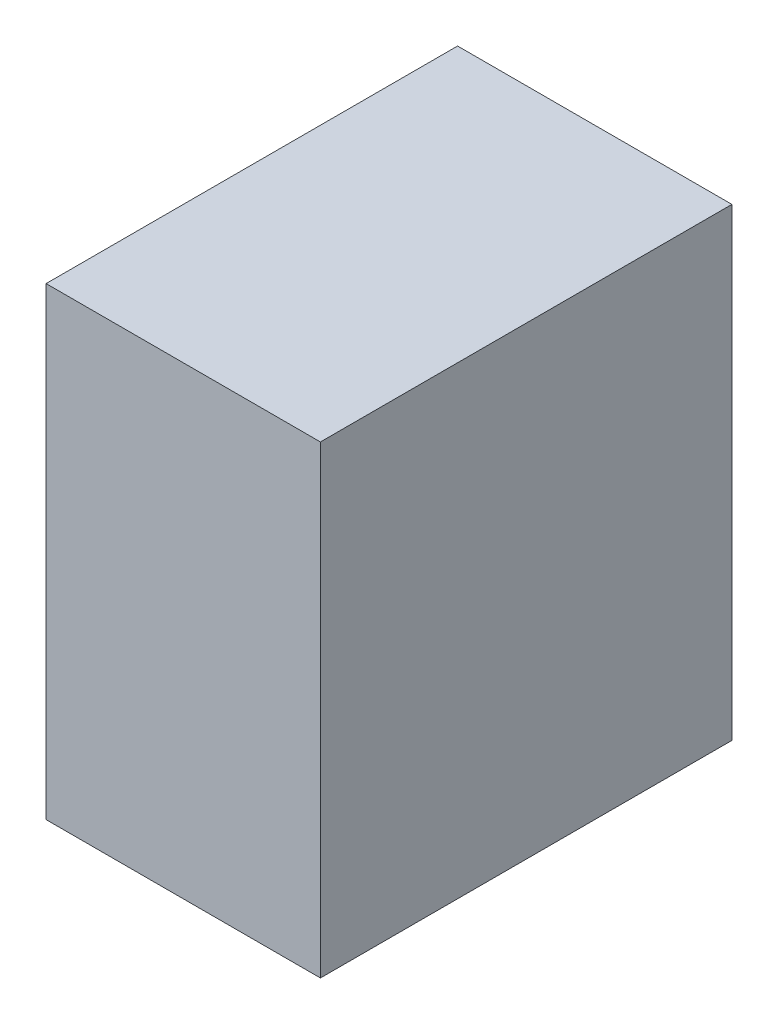
ISO-10303-21;
HEADER;
FILE_DESCRIPTION(('STEP AP214'),'2;1');
FILE_NAME('part.step','',(''),(''),'','','');
FILE_SCHEMA(('AUTOMOTIVE_DESIGN { 1 0 10303 214 1 1 1 1 }'));
ENDSEC;
DATA;
#1=APPLICATION_CONTEXT('core data for automotive mechanical design processes');
#2=APPLICATION_PROTOCOL_DEFINITION('international standard','automotive_design',2000,#1);
#3=PRODUCT_CONTEXT('',#1,'mechanical');
#4=PRODUCT('Part','Part','',(#3));
#5=PRODUCT_RELATED_PRODUCT_CATEGORY('part','',(#4));
#6=PRODUCT_DEFINITION_FORMATION('','',#4);
#7=PRODUCT_DEFINITION_CONTEXT('part definition',#1,'design');
#8=PRODUCT_DEFINITION('design','',#6,#7);
#9=PRODUCT_DEFINITION_SHAPE('','',#8);
#10=(LENGTH_UNIT() NAMED_UNIT(*) SI_UNIT(.MILLI.,.METRE.));
#11=(NAMED_UNIT(*) PLANE_ANGLE_UNIT() SI_UNIT($,.RADIAN.));
#12=(NAMED_UNIT(*) SI_UNIT($,.STERADIAN.) SOLID_ANGLE_UNIT());
#13=UNCERTAINTY_MEASURE_WITH_UNIT(LENGTH_MEASURE(1.E-05),#10,'distance_accuracy_value','');
#14=(GEOMETRIC_REPRESENTATION_CONTEXT(3) GLOBAL_UNCERTAINTY_ASSIGNED_CONTEXT((#13)) GLOBAL_UNIT_ASSIGNED_CONTEXT((#10,
#11,#12)) REPRESENTATION_CONTEXT('',''));
#15=CARTESIAN_POINT('',(0.,0.,0.));
#16=DIRECTION('',(0.,0.,1.));
#17=DIRECTION('',(1.,0.,0.));
#18=AXIS2_PLACEMENT_3D('',#15,#16,#17);
#19=CARTESIAN_POINT('',(-0.33019746,-0.5588,0.));
#20=DIRECTION('',(-1.,0.,0.));
#21=DIRECTION('',(0.,1.,0.));
#22=AXIS2_PLACEMENT_3D('',#19,#20,#21);
#23=PLANE('',#22);
#24=DIRECTION('',(0.,0.,1.));
#25=VECTOR('',#24,1.);
#26=CARTESIAN_POINT('',(-0.33019746,-0.5588,0.));
#27=LINE('',#26,#25);
#28=CARTESIAN_POINT('',(-0.33019746,-0.5588,0.));
#29=VERTEX_POINT('',#28);
#30=CARTESIAN_POINT('',(-0.33019746,-0.5588,0.9906));
#31=VERTEX_POINT('',#30);
#32=EDGE_CURVE('E11',#29,#31,#27,.T.);
#33=ORIENTED_EDGE('',*,*,#32,.T.);
#34=DIRECTION('',(0.,1.,0.));
#35=VECTOR('',#34,1.);
#36=CARTESIAN_POINT('',(-0.33019746,-0.5588,0.9906));
#37=LINE('',#36,#35);
#38=CARTESIAN_POINT('',(-0.33019746,0.5588,0.9906));
#39=VERTEX_POINT('',#38);
#40=EDGE_CURVE('E24',#31,#39,#37,.T.);
#41=ORIENTED_EDGE('',*,*,#40,.T.);
#42=DIRECTION('',(0.,0.,1.));
#43=VECTOR('',#42,1.);
#44=CARTESIAN_POINT('',(-0.33019746,0.5588,0.));
#45=LINE('',#44,#43);
#46=CARTESIAN_POINT('',(-0.33019746,0.5588,0.));
#47=VERTEX_POINT('',#46);
#48=EDGE_CURVE('E85',#47,#39,#45,.T.);
#49=ORIENTED_EDGE('',*,*,#48,.F.);
#50=DIRECTION('',(0.,1.,0.));
#51=VECTOR('',#50,1.);
#52=CARTESIAN_POINT('',(-0.33019746,-0.5588,0.));
#53=LINE('',#52,#51);
#54=EDGE_CURVE('E83',#29,#47,#53,.T.);
#55=ORIENTED_EDGE('',*,*,#54,.F.);
#56=EDGE_LOOP('',(#33,#41,#49,#55));
#57=FACE_BOUND('',#56,.T.);
#58=ADVANCED_FACE('F17',(#57),#23,.T.);
#59=CARTESIAN_POINT('',(-0.33019746,0.5588,0.));
#60=DIRECTION('',(-3.84616864529347E-06,0.999999999992603,0.));
#61=DIRECTION('',(0.999999999992603,3.84616864529347E-06,0.));
#62=AXIS2_PLACEMENT_3D('',#59,#60,#61);
#63=PLANE('',#62);
#64=ORIENTED_EDGE('',*,*,#48,.T.);
#65=DIRECTION('',(0.999999999992603,3.84616864529347E-06,0.));
#66=VECTOR('',#65,1.);
#67=CARTESIAN_POINT('',(-0.33019746,0.5588,0.9906));
#68=LINE('',#67,#66);
#69=CARTESIAN_POINT('',(0.3302,0.55880254,0.9906));
#70=VERTEX_POINT('',#69);
#71=EDGE_CURVE('E81',#39,#70,#68,.T.);
#72=ORIENTED_EDGE('',*,*,#71,.T.);
#73=DIRECTION('',(0.,0.,1.));
#74=VECTOR('',#73,1.);
#75=CARTESIAN_POINT('',(0.3302,0.55880254,0.));
#76=LINE('',#75,#74);
#77=CARTESIAN_POINT('',(0.3302,0.55880254,0.));
#78=VERTEX_POINT('',#77);
#79=EDGE_CURVE('E79',#78,#70,#76,.T.);
#80=ORIENTED_EDGE('',*,*,#79,.F.);
#81=DIRECTION('',(0.999999999992603,3.84616864529347E-06,0.));
#82=VECTOR('',#81,1.);
#83=CARTESIAN_POINT('',(-0.33019746,0.5588,0.));
#84=LINE('',#83,#82);
#85=EDGE_CURVE('E70',#47,#78,#84,.T.);
#86=ORIENTED_EDGE('',*,*,#85,.F.);
#87=EDGE_LOOP('',(#64,#72,#80,#86));
#88=FACE_BOUND('',#87,.T.);
#89=ADVANCED_FACE('F90',(#88),#63,.T.);
#90=CARTESIAN_POINT('',(0.3302,0.55880254,0.));
#91=DIRECTION('',(1.,0.,0.));
#92=DIRECTION('',(0.,-1.,0.));
#93=AXIS2_PLACEMENT_3D('',#90,#91,#92);
#94=PLANE('',#93);
#95=ORIENTED_EDGE('',*,*,#79,.T.);
#96=DIRECTION('',(0.,-1.,0.));
#97=VECTOR('',#96,1.);
#98=CARTESIAN_POINT('',(0.3302,0.55880254,0.9906));
#99=LINE('',#98,#97);
#100=CARTESIAN_POINT('',(0.3302,-0.55879746,0.9906));
#101=VERTEX_POINT('',#100);
#102=EDGE_CURVE('E60',#70,#101,#99,.T.);
#103=ORIENTED_EDGE('',*,*,#102,.T.);
#104=DIRECTION('',(0.,0.,1.));
#105=VECTOR('',#104,1.);
#106=CARTESIAN_POINT('',(0.3302,-0.55879746,0.));
#107=LINE('',#106,#105);
#108=CARTESIAN_POINT('',(0.3302,-0.55879746,0.));
#109=VERTEX_POINT('',#108);
#110=EDGE_CURVE('E54',#109,#101,#107,.T.);
#111=ORIENTED_EDGE('',*,*,#110,.F.);
#112=DIRECTION('',(0.,-1.,0.));
#113=VECTOR('',#112,1.);
#114=CARTESIAN_POINT('',(0.3302,0.55880254,0.));
#115=LINE('',#114,#113);
#116=EDGE_CURVE('E58',#78,#109,#115,.T.);
#117=ORIENTED_EDGE('',*,*,#116,.F.);
#118=EDGE_LOOP('',(#95,#103,#111,#117));
#119=FACE_BOUND('',#118,.T.);
#120=ADVANCED_FACE('F57',(#119),#94,.T.);
#121=CARTESIAN_POINT('',(0.3302,-0.55879746,0.));
#122=DIRECTION('',(3.84616864529347E-06,-0.999999999992603,0.));
#123=DIRECTION('',(-0.999999999992603,-3.84616864529347E-06,0.));
#124=AXIS2_PLACEMENT_3D('',#121,#122,#123);
#125=PLANE('',#124);
#126=ORIENTED_EDGE('',*,*,#110,.T.);
#127=DIRECTION('',(-0.999999999992603,-3.84616864529347E-06,0.));
#128=VECTOR('',#127,1.);
#129=CARTESIAN_POINT('',(0.3302,-0.55879746,0.9906));
#130=LINE('',#129,#128);
#131=EDGE_CURVE('E71',#101,#31,#130,.T.);
#132=ORIENTED_EDGE('',*,*,#131,.T.);
#133=ORIENTED_EDGE('',*,*,#32,.F.);
#134=DIRECTION('',(-0.999999999992603,-3.84616864529347E-06,0.));
#135=VECTOR('',#134,1.);
#136=CARTESIAN_POINT('',(0.3302,-0.55879746,0.));
#137=LINE('',#136,#135);
#138=EDGE_CURVE('E68',#109,#29,#137,.T.);
#139=ORIENTED_EDGE('',*,*,#138,.F.);
#140=EDGE_LOOP('',(#126,#132,#133,#139));
#141=FACE_BOUND('',#140,.T.);
#142=ADVANCED_FACE('F73',(#141),#125,.T.);
#143=CARTESIAN_POINT('',(1.269999998507E-06,1.270000002066E-06,0.));
#144=DIRECTION('',(0.,0.,-1.));
#145=DIRECTION('',(-1.,0.,0.));
#146=AXIS2_PLACEMENT_3D('',#143,#144,#145);
#147=PLANE('',#146);
#148=ORIENTED_EDGE('',*,*,#54,.T.);
#149=ORIENTED_EDGE('',*,*,#85,.T.);
#150=ORIENTED_EDGE('',*,*,#116,.T.);
#151=ORIENTED_EDGE('',*,*,#138,.T.);
#152=EDGE_LOOP('',(#148,#149,#150,#151));
#153=FACE_BOUND('',#152,.T.);
#154=ADVANCED_FACE('F67',(#153),#147,.T.);
#155=CARTESIAN_POINT('',(1.269999998507E-06,1.270000002066E-06,0.9906));
#156=DIRECTION('',(0.,0.,-1.));
#157=DIRECTION('',(-1.,0.,0.));
#158=AXIS2_PLACEMENT_3D('',#155,#156,#157);
#159=PLANE('',#158);
#160=ORIENTED_EDGE('',*,*,#131,.F.);
#161=ORIENTED_EDGE('',*,*,#102,.F.);
#162=ORIENTED_EDGE('',*,*,#71,.F.);
#163=ORIENTED_EDGE('',*,*,#40,.F.);
#164=EDGE_LOOP('',(#160,#161,#162,#163));
#165=FACE_BOUND('',#164,.T.);
#166=ADVANCED_FACE('F91',(#165),#159,.F.);
#167=CLOSED_SHELL('',(#58,#89,#120,#142,#154,#166));
#168=MANIFOLD_SOLID_BREP('B1',#167);
#169=ADVANCED_BREP_SHAPE_REPRESENTATION('',(#18,#168),#14);
#170=SHAPE_DEFINITION_REPRESENTATION(#9,#169);
ENDSEC;
END-ISO-10303-21;
